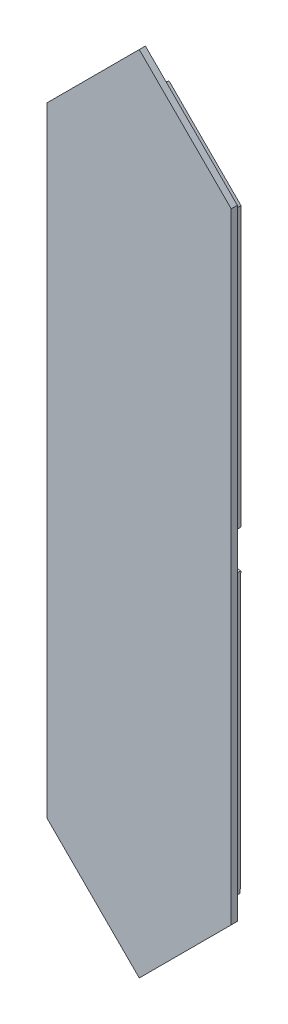
ISO-10303-21;
HEADER;
FILE_DESCRIPTION(('STEP AP214'),'2;1');
FILE_NAME('part.step','',(''),(''),'','','');
FILE_SCHEMA(('AUTOMOTIVE_DESIGN { 1 0 10303 214 1 1 1 1 }'));
ENDSEC;
DATA;
#1=APPLICATION_CONTEXT('core data for automotive mechanical design processes');
#2=APPLICATION_PROTOCOL_DEFINITION('international standard','automotive_design',2000,#1);
#3=PRODUCT_CONTEXT('',#1,'mechanical');
#4=PRODUCT('Part','Part','',(#3));
#5=PRODUCT_RELATED_PRODUCT_CATEGORY('part','',(#4));
#6=PRODUCT_DEFINITION_FORMATION('','',#4);
#7=PRODUCT_DEFINITION_CONTEXT('part definition',#1,'design');
#8=PRODUCT_DEFINITION('design','',#6,#7);
#9=PRODUCT_DEFINITION_SHAPE('','',#8);
#10=(LENGTH_UNIT() NAMED_UNIT(*) SI_UNIT(.MILLI.,.METRE.));
#11=(NAMED_UNIT(*) PLANE_ANGLE_UNIT() SI_UNIT($,.RADIAN.));
#12=(NAMED_UNIT(*) SI_UNIT($,.STERADIAN.) SOLID_ANGLE_UNIT());
#13=UNCERTAINTY_MEASURE_WITH_UNIT(LENGTH_MEASURE(1.E-05),#10,'distance_accuracy_value','');
#14=(GEOMETRIC_REPRESENTATION_CONTEXT(3) GLOBAL_UNCERTAINTY_ASSIGNED_CONTEXT((#13)) GLOBAL_UNIT_ASSIGNED_CONTEXT((#10,
#11,#12)) REPRESENTATION_CONTEXT('',''));
#15=CARTESIAN_POINT('',(0.,0.,0.));
#16=DIRECTION('',(0.,0.,1.));
#17=DIRECTION('',(1.,0.,0.));
#18=AXIS2_PLACEMENT_3D('',#15,#16,#17);
#19=CARTESIAN_POINT('',(0.,62.,2.));
#20=DIRECTION('',(0.,0.,-1.));
#21=DIRECTION('',(-1.,0.,0.));
#22=AXIS2_PLACEMENT_3D('',#19,#20,#21);
#23=CYLINDRICAL_SURFACE('',#22,2.6);
#24=CARTESIAN_POINT('',(0.,62.,0.));
#25=DIRECTION('',(0.,0.,-1.));
#26=DIRECTION('',(1.,0.,0.));
#27=AXIS2_PLACEMENT_3D('',#24,#25,#26);
#28=CIRCLE('',#27,2.6);
#29=CARTESIAN_POINT('',(1.83847763108502,60.161522368915,0.));
#30=VERTEX_POINT('',#29);
#31=CARTESIAN_POINT('',(-1.83847763108503,60.161522368915,0.));
#32=VERTEX_POINT('',#31);
#33=EDGE_CURVE('E167',#30,#32,#28,.T.);
#34=ORIENTED_EDGE('',*,*,#33,.T.);
#35=DIRECTION('',(0.,0.,-1.));
#36=VECTOR('',#35,1.);
#37=CARTESIAN_POINT('',(-1.83847763108503,60.161522368915,2.));
#38=LINE('',#37,#36);
#39=CARTESIAN_POINT('',(-1.83847763108503,60.161522368915,2.));
#40=VERTEX_POINT('',#39);
#41=EDGE_CURVE('E11',#40,#32,#38,.T.);
#42=ORIENTED_EDGE('',*,*,#41,.F.);
#43=CARTESIAN_POINT('',(0.,62.,2.));
#44=DIRECTION('',(0.,0.,-1.));
#45=DIRECTION('',(1.,0.,0.));
#46=AXIS2_PLACEMENT_3D('',#43,#44,#45);
#47=CIRCLE('',#46,2.6);
#48=CARTESIAN_POINT('',(1.83847763108502,60.161522368915,2.));
#49=VERTEX_POINT('',#48);
#50=EDGE_CURVE('E190',#49,#40,#47,.T.);
#51=ORIENTED_EDGE('',*,*,#50,.F.);
#52=DIRECTION('',(0.,0.,-1.));
#53=VECTOR('',#52,1.);
#54=CARTESIAN_POINT('',(1.83847763108502,60.161522368915,2.));
#55=LINE('',#54,#53);
#56=EDGE_CURVE('E166',#49,#30,#55,.T.);
#57=ORIENTED_EDGE('',*,*,#56,.T.);
#58=EDGE_LOOP('',(#34,#42,#51,#57));
#59=FACE_BOUND('',#58,.T.);
#60=ADVANCED_FACE('F34',(#59),#23,.F.);
#61=CARTESIAN_POINT('',(-1.83847763108503,60.161522368915,2.));
#62=DIRECTION('',(0.704379980368026,-0.709823107018036,0.));
#63=DIRECTION('',(0.709823107018037,0.704379980368026,0.));
#64=AXIS2_PLACEMENT_3D('',#61,#62,#63);
#65=PLANE('',#64);
#66=DIRECTION('',(-0.709823107018037,-0.704379980368026,0.));
#67=VECTOR('',#66,1.);
#68=CARTESIAN_POINT('',(-1.83847763108503,60.161522368915,0.));
#69=LINE('',#68,#67);
#70=CARTESIAN_POINT('',(-13.1033285786008,48.9830535211007,0.));
#71=VERTEX_POINT('',#70);
#72=EDGE_CURVE('E170',#32,#71,#69,.T.);
#73=ORIENTED_EDGE('',*,*,#72,.T.);
#74=DIRECTION('',(0.,0.,-1.));
#75=VECTOR('',#74,1.);
#76=CARTESIAN_POINT('',(-13.1033285786008,48.9830535211007,2.));
#77=LINE('',#76,#75);
#78=CARTESIAN_POINT('',(-13.1033285786008,48.9830535211007,2.));
#79=VERTEX_POINT('',#78);
#80=EDGE_CURVE('E42',#79,#71,#77,.T.);
#81=ORIENTED_EDGE('',*,*,#80,.F.);
#82=DIRECTION('',(-0.709823107018037,-0.704379980368026,0.));
#83=VECTOR('',#82,1.);
#84=CARTESIAN_POINT('',(-1.83847763108503,60.161522368915,2.));
#85=LINE('',#84,#83);
#86=EDGE_CURVE('E104',#40,#79,#85,.T.);
#87=ORIENTED_EDGE('',*,*,#86,.F.);
#88=ORIENTED_EDGE('',*,*,#41,.T.);
#89=EDGE_LOOP('',(#73,#81,#87,#88));
#90=FACE_BOUND('',#89,.T.);
#91=ADVANCED_FACE('F354',(#90),#65,.F.);
#92=CARTESIAN_POINT('',(-13.1033285786008,48.9830535211007,2.));
#93=DIRECTION('',(1.,0.,0.));
#94=DIRECTION('',(0.,0.,-1.));
#95=AXIS2_PLACEMENT_3D('',#92,#93,#94);
#96=PLANE('',#95);
#97=DIRECTION('',(0.,-1.,0.));
#98=VECTOR('',#97,1.);
#99=CARTESIAN_POINT('',(-13.1033285786008,48.9830535211007,0.));
#100=LINE('',#99,#98);
#101=CARTESIAN_POINT('',(-13.1033285786008,3.07451651214383,0.));
#102=VERTEX_POINT('',#101);
#103=EDGE_CURVE('E173',#71,#102,#100,.T.);
#104=ORIENTED_EDGE('',*,*,#103,.T.);
#105=DIRECTION('',(0.,0.,-1.));
#106=VECTOR('',#105,1.);
#107=CARTESIAN_POINT('',(-13.1033285786008,3.07451651214383,2.));
#108=LINE('',#107,#106);
#109=CARTESIAN_POINT('',(-13.1033285786008,3.07451651214383,2.));
#110=VERTEX_POINT('',#109);
#111=EDGE_CURVE('E207',#110,#102,#108,.T.);
#112=ORIENTED_EDGE('',*,*,#111,.F.);
#113=DIRECTION('',(0.,-1.,0.));
#114=VECTOR('',#113,1.);
#115=CARTESIAN_POINT('',(-13.1033285786008,48.9830535211007,2.));
#116=LINE('',#115,#114);
#117=EDGE_CURVE('E215',#79,#110,#116,.T.);
#118=ORIENTED_EDGE('',*,*,#117,.F.);
#119=ORIENTED_EDGE('',*,*,#80,.T.);
#120=EDGE_LOOP('',(#104,#112,#118,#119));
#121=FACE_BOUND('',#120,.T.);
#122=ADVANCED_FACE('F213',(#121),#96,.F.);
#123=CARTESIAN_POINT('',(-13.5000000000001,0.,2.));
#124=DIRECTION('',(0.,0.,-1.));
#125=DIRECTION('',(-1.,0.,0.));
#126=AXIS2_PLACEMENT_3D('',#123,#124,#125);
#127=CYLINDRICAL_SURFACE('',#126,3.1);
#128=CARTESIAN_POINT('',(-13.5000000000001,0.,0.));
#129=DIRECTION('',(0.,0.,-1.));
#130=DIRECTION('',(1.,0.,0.));
#131=AXIS2_PLACEMENT_3D('',#128,#129,#130);
#132=CIRCLE('',#131,3.1);
#133=CARTESIAN_POINT('',(-13.1033285786008,-3.07451651214383,0.));
#134=VERTEX_POINT('',#133);
#135=EDGE_CURVE('E175',#102,#134,#132,.T.);
#136=ORIENTED_EDGE('',*,*,#135,.T.);
#137=DIRECTION('',(0.,0.,-1.));
#138=VECTOR('',#137,1.);
#139=CARTESIAN_POINT('',(-13.1033285786008,-3.07451651214383,2.));
#140=LINE('',#139,#138);
#141=CARTESIAN_POINT('',(-13.1033285786008,-3.07451651214383,2.));
#142=VERTEX_POINT('',#141);
#143=EDGE_CURVE('E204',#142,#134,#140,.T.);
#144=ORIENTED_EDGE('',*,*,#143,.F.);
#145=CARTESIAN_POINT('',(-13.5000000000001,0.,2.));
#146=DIRECTION('',(0.,0.,-1.));
#147=DIRECTION('',(1.,0.,0.));
#148=AXIS2_PLACEMENT_3D('',#145,#146,#147);
#149=CIRCLE('',#148,3.1);
#150=EDGE_CURVE('E234',#110,#142,#149,.T.);
#151=ORIENTED_EDGE('',*,*,#150,.F.);
#152=ORIENTED_EDGE('',*,*,#111,.T.);
#153=EDGE_LOOP('',(#136,#144,#151,#152));
#154=FACE_BOUND('',#153,.T.);
#155=ADVANCED_FACE('F223',(#154),#127,.F.);
#156=CARTESIAN_POINT('',(-13.1033285786008,-3.07451651214383,2.));
#157=DIRECTION('',(0.999998333354842,-0.00182572931658265,0.));
#158=DIRECTION('',(0.00182572931658265,0.999998333354842,0.));
#159=AXIS2_PLACEMENT_3D('',#156,#157,#158);
#160=PLANE('',#159);
#161=DIRECTION('',(-0.00182572931658265,-0.999998333354842,0.));
#162=VECTOR('',#161,1.);
#163=CARTESIAN_POINT('',(-13.1033285786008,-3.07451651214383,0.));
#164=LINE('',#163,#162);
#165=CARTESIAN_POINT('',(-13.1868351090227,-48.8131648909774,0.));
#166=VERTEX_POINT('',#165);
#167=EDGE_CURVE('E177',#134,#166,#164,.T.);
#168=ORIENTED_EDGE('',*,*,#167,.T.);
#169=DIRECTION('',(0.,0.,-1.));
#170=VECTOR('',#169,1.);
#171=CARTESIAN_POINT('',(-13.1868351090227,-48.8131648909774,2.));
#172=LINE('',#171,#170);
#173=CARTESIAN_POINT('',(-13.1868351090227,-48.8131648909774,2.));
#174=VERTEX_POINT('',#173);
#175=EDGE_CURVE('E201',#174,#166,#172,.T.);
#176=ORIENTED_EDGE('',*,*,#175,.F.);
#177=DIRECTION('',(-0.00182572931658265,-0.999998333354842,0.));
#178=VECTOR('',#177,1.);
#179=CARTESIAN_POINT('',(-13.1033285786008,-3.07451651214383,2.));
#180=LINE('',#179,#178);
#181=EDGE_CURVE('E229',#142,#174,#180,.T.);
#182=ORIENTED_EDGE('',*,*,#181,.F.);
#183=ORIENTED_EDGE('',*,*,#143,.T.);
#184=EDGE_LOOP('',(#168,#176,#182,#183));
#185=FACE_BOUND('',#184,.T.);
#186=ADVANCED_FACE('F227',(#185),#160,.F.);
#187=CARTESIAN_POINT('',(-13.1868351090227,-48.8131648909774,2.));
#188=DIRECTION('',(0.707106781186547,0.707106781186547,0.));
#189=DIRECTION('',(-0.707106781186548,0.707106781186548,0.));
#190=AXIS2_PLACEMENT_3D('',#187,#188,#189);
#191=PLANE('',#190);
#192=DIRECTION('',(0.707106781186547,-0.707106781186547,0.));
#193=VECTOR('',#192,1.);
#194=CARTESIAN_POINT('',(-13.1868351090227,-48.8131648909774,0.));
#195=LINE('',#194,#193);
#196=CARTESIAN_POINT('',(-1.83847763108514,-60.161522368915,0.));
#197=VERTEX_POINT('',#196);
#198=EDGE_CURVE('E179',#166,#197,#195,.T.);
#199=ORIENTED_EDGE('',*,*,#198,.T.);
#200=DIRECTION('',(0.,0.,-1.));
#201=VECTOR('',#200,1.);
#202=CARTESIAN_POINT('',(-1.83847763108514,-60.161522368915,2.));
#203=LINE('',#202,#201);
#204=CARTESIAN_POINT('',(-1.83847763108514,-60.161522368915,2.));
#205=VERTEX_POINT('',#204);
#206=EDGE_CURVE('E198',#205,#197,#203,.T.);
#207=ORIENTED_EDGE('',*,*,#206,.F.);
#208=DIRECTION('',(0.707106781186547,-0.707106781186547,0.));
#209=VECTOR('',#208,1.);
#210=CARTESIAN_POINT('',(-13.1868351090227,-48.8131648909774,2.));
#211=LINE('',#210,#209);
#212=EDGE_CURVE('E233',#174,#205,#211,.T.);
#213=ORIENTED_EDGE('',*,*,#212,.F.);
#214=ORIENTED_EDGE('',*,*,#175,.T.);
#215=EDGE_LOOP('',(#199,#207,#213,#214));
#216=FACE_BOUND('',#215,.T.);
#217=ADVANCED_FACE('F367',(#216),#191,.F.);
#218=CARTESIAN_POINT('',(-1.32427131676642E-13,-62.,2.));
#219=DIRECTION('',(0.,0.,-1.));
#220=DIRECTION('',(-1.,0.,0.));
#221=AXIS2_PLACEMENT_3D('',#218,#219,#220);
#222=CYLINDRICAL_SURFACE('',#221,2.6);
#223=CARTESIAN_POINT('',(-1.32427131676642E-13,-62.,0.));
#224=DIRECTION('',(0.,0.,-1.));
#225=DIRECTION('',(1.,0.,0.));
#226=AXIS2_PLACEMENT_3D('',#223,#224,#225);
#227=CIRCLE('',#226,2.6);
#228=CARTESIAN_POINT('',(1.83847763108488,-60.161522368915,0.));
#229=VERTEX_POINT('',#228);
#230=EDGE_CURVE('E181',#197,#229,#227,.T.);
#231=ORIENTED_EDGE('',*,*,#230,.T.);
#232=DIRECTION('',(0.,0.,-1.));
#233=VECTOR('',#232,1.);
#234=CARTESIAN_POINT('',(1.83847763108488,-60.161522368915,2.));
#235=LINE('',#234,#233);
#236=CARTESIAN_POINT('',(1.83847763108488,-60.161522368915,2.));
#237=VERTEX_POINT('',#236);
#238=EDGE_CURVE('E195',#237,#229,#235,.T.);
#239=ORIENTED_EDGE('',*,*,#238,.F.);
#240=CARTESIAN_POINT('',(-1.32427131676642E-13,-62.,2.));
#241=DIRECTION('',(0.,0.,-1.));
#242=DIRECTION('',(1.,0.,0.));
#243=AXIS2_PLACEMENT_3D('',#240,#241,#242);
#244=CIRCLE('',#243,2.6);
#245=EDGE_CURVE('E158',#205,#237,#244,.T.);
#246=ORIENTED_EDGE('',*,*,#245,.F.);
#247=ORIENTED_EDGE('',*,*,#206,.T.);
#248=EDGE_LOOP('',(#231,#239,#246,#247));
#249=FACE_BOUND('',#248,.T.);
#250=ADVANCED_FACE('F242',(#249),#222,.F.);
#251=CARTESIAN_POINT('',(1.83847763108488,-60.161522368915,2.));
#252=DIRECTION('',(-0.705787571806319,0.708423533970844,0.));
#253=DIRECTION('',(-0.708423533970844,-0.705787571806319,0.));
#254=AXIS2_PLACEMENT_3D('',#251,#252,#253);
#255=PLANE('',#254);
#256=DIRECTION('',(0.708423533970844,0.705787571806319,0.));
#257=VECTOR('',#256,1.);
#258=CARTESIAN_POINT('',(1.83847763108488,-60.161522368915,0.));
#259=LINE('',#258,#257);
#260=CARTESIAN_POINT('',(13.4432523333034,-48.5999276932992,0.));
#261=VERTEX_POINT('',#260);
#262=EDGE_CURVE('E183',#229,#261,#259,.T.);
#263=ORIENTED_EDGE('',*,*,#262,.T.);
#264=DIRECTION('',(0.,0.,-1.));
#265=VECTOR('',#264,1.);
#266=CARTESIAN_POINT('',(13.4432523333034,-48.5999276932992,2.));
#267=LINE('',#266,#265);
#268=CARTESIAN_POINT('',(13.4432523333034,-48.5999276932992,2.));
#269=VERTEX_POINT('',#268);
#270=EDGE_CURVE('E142',#269,#261,#267,.T.);
#271=ORIENTED_EDGE('',*,*,#270,.F.);
#272=DIRECTION('',(0.708423533970844,0.705787571806319,0.));
#273=VECTOR('',#272,1.);
#274=CARTESIAN_POINT('',(1.83847763108488,-60.161522368915,2.));
#275=LINE('',#274,#273);
#276=EDGE_CURVE('E156',#237,#269,#275,.T.);
#277=ORIENTED_EDGE('',*,*,#276,.F.);
#278=ORIENTED_EDGE('',*,*,#238,.T.);
#279=EDGE_LOOP('',(#263,#271,#277,#278));
#280=FACE_BOUND('',#279,.T.);
#281=ADVANCED_FACE('F246',(#280),#255,.F.);
#282=CARTESIAN_POINT('',(13.4432523333034,-48.5999276932992,2.));
#283=DIRECTION('',(-0.999998333354842,0.0018257293165825,0.));
#284=DIRECTION('',(-0.0018257293165825,-0.999998333354842,0.));
#285=AXIS2_PLACEMENT_3D('',#282,#283,#284);
#286=PLANE('',#285);
#287=DIRECTION('',(0.0018257293165825,0.999998333354842,0.));
#288=VECTOR('',#287,1.);
#289=CARTESIAN_POINT('',(13.4432523333034,-48.5999276932992,0.));
#290=LINE('',#289,#288);
#291=CARTESIAN_POINT('',(13.5263232276925,-3.09988823793437,0.));
#292=VERTEX_POINT('',#291);
#293=EDGE_CURVE('E139',#261,#292,#290,.T.);
#294=ORIENTED_EDGE('',*,*,#293,.T.);
#295=DIRECTION('',(0.,0.,-1.));
#296=VECTOR('',#295,1.);
#297=CARTESIAN_POINT('',(13.5263232276925,-3.09988823793437,2.));
#298=LINE('',#297,#296);
#299=CARTESIAN_POINT('',(13.5263232276925,-3.09988823793437,2.));
#300=VERTEX_POINT('',#299);
#301=EDGE_CURVE('E131',#300,#292,#298,.T.);
#302=ORIENTED_EDGE('',*,*,#301,.F.);
#303=DIRECTION('',(0.0018257293165825,0.999998333354842,0.));
#304=VECTOR('',#303,1.);
#305=CARTESIAN_POINT('',(13.4432523333034,-48.5999276932992,2.));
#306=LINE('',#305,#304);
#307=EDGE_CURVE('E136',#269,#300,#306,.T.);
#308=ORIENTED_EDGE('',*,*,#307,.F.);
#309=ORIENTED_EDGE('',*,*,#270,.T.);
#310=EDGE_LOOP('',(#294,#302,#308,#309));
#311=FACE_BOUND('',#310,.T.);
#312=ADVANCED_FACE('F133',(#311),#286,.F.);
#313=CARTESIAN_POINT('',(13.5,0.,2.));
#314=DIRECTION('',(0.,0.,-1.));
#315=DIRECTION('',(-1.,0.,0.));
#316=AXIS2_PLACEMENT_3D('',#313,#314,#315);
#317=CYLINDRICAL_SURFACE('',#316,3.1);
#318=CARTESIAN_POINT('',(13.5,0.,0.));
#319=DIRECTION('',(0.,0.,-1.));
#320=DIRECTION('',(1.,0.,0.));
#321=AXIS2_PLACEMENT_3D('',#318,#319,#320);
#322=CIRCLE('',#321,3.1);
#323=CARTESIAN_POINT('',(13.5707106781187,3.09919344346235,0.));
#324=VERTEX_POINT('',#323);
#325=EDGE_CURVE('E186',#292,#324,#322,.T.);
#326=ORIENTED_EDGE('',*,*,#325,.T.);
#327=DIRECTION('',(0.,0.,-1.));
#328=VECTOR('',#327,1.);
#329=CARTESIAN_POINT('',(13.5707106781187,3.09919344346235,2.));
#330=LINE('',#329,#328);
#331=CARTESIAN_POINT('',(13.5707106781187,3.09919344346235,2.));
#332=VERTEX_POINT('',#331);
#333=EDGE_CURVE('E143',#332,#324,#330,.T.);
#334=ORIENTED_EDGE('',*,*,#333,.F.);
#335=CARTESIAN_POINT('',(13.5,0.,2.));
#336=DIRECTION('',(0.,0.,-1.));
#337=DIRECTION('',(1.,0.,0.));
#338=AXIS2_PLACEMENT_3D('',#335,#336,#337);
#339=CIRCLE('',#338,3.1);
#340=EDGE_CURVE('E146',#300,#332,#339,.T.);
#341=ORIENTED_EDGE('',*,*,#340,.F.);
#342=ORIENTED_EDGE('',*,*,#301,.T.);
#343=EDGE_LOOP('',(#326,#334,#341,#342));
#344=FACE_BOUND('',#343,.T.);
#345=ADVANCED_FACE('F147',(#344),#317,.F.);
#346=CARTESIAN_POINT('',(13.5707106781187,3.09919344346235,2.));
#347=DIRECTION('',(-1.,0.,0.));
#348=DIRECTION('',(0.,-1.,0.));
#349=AXIS2_PLACEMENT_3D('',#346,#347,#348);
#350=PLANE('',#349);
#351=DIRECTION('',(0.,1.,0.));
#352=VECTOR('',#351,1.);
#353=CARTESIAN_POINT('',(13.5707106781187,3.09919344346235,0.));
#354=LINE('',#353,#352);
#355=CARTESIAN_POINT('',(13.5707106781187,48.4292893218813,0.));
#356=VERTEX_POINT('',#355);
#357=EDGE_CURVE('E90',#324,#356,#354,.T.);
#358=ORIENTED_EDGE('',*,*,#357,.T.);
#359=DIRECTION('',(0.,0.,-1.));
#360=VECTOR('',#359,1.);
#361=CARTESIAN_POINT('',(13.5707106781187,48.4292893218813,2.));
#362=LINE('',#361,#360);
#363=CARTESIAN_POINT('',(13.5707106781187,48.4292893218813,2.));
#364=VERTEX_POINT('',#363);
#365=EDGE_CURVE('E50',#364,#356,#362,.T.);
#366=ORIENTED_EDGE('',*,*,#365,.F.);
#367=DIRECTION('',(0.,1.,0.));
#368=VECTOR('',#367,1.);
#369=CARTESIAN_POINT('',(13.5707106781187,3.09919344346235,2.));
#370=LINE('',#369,#368);
#371=EDGE_CURVE('E150',#332,#364,#370,.T.);
#372=ORIENTED_EDGE('',*,*,#371,.F.);
#373=ORIENTED_EDGE('',*,*,#333,.T.);
#374=EDGE_LOOP('',(#358,#366,#372,#373));
#375=FACE_BOUND('',#374,.T.);
#376=ADVANCED_FACE('F247',(#375),#350,.F.);
#377=CARTESIAN_POINT('',(13.5707106781187,48.4292893218813,2.));
#378=DIRECTION('',(-0.707106781186547,-0.707106781186547,0.));
#379=DIRECTION('',(0.707106781186548,-0.707106781186548,0.));
#380=AXIS2_PLACEMENT_3D('',#377,#378,#379);
#381=PLANE('',#380);
#382=DIRECTION('',(-0.707106781186548,0.707106781186548,0.));
#383=VECTOR('',#382,1.);
#384=CARTESIAN_POINT('',(13.5707106781187,48.4292893218813,0.));
#385=LINE('',#384,#383);
#386=EDGE_CURVE('E96',#356,#30,#385,.T.);
#387=ORIENTED_EDGE('',*,*,#386,.T.);
#388=ORIENTED_EDGE('',*,*,#56,.F.);
#389=DIRECTION('',(-0.707106781186548,0.707106781186548,0.));
#390=VECTOR('',#389,1.);
#391=CARTESIAN_POINT('',(13.5707106781187,48.4292893218813,2.));
#392=LINE('',#391,#390);
#393=EDGE_CURVE('E163',#364,#49,#392,.T.);
#394=ORIENTED_EDGE('',*,*,#393,.F.);
#395=ORIENTED_EDGE('',*,*,#365,.T.);
#396=EDGE_LOOP('',(#387,#388,#394,#395));
#397=FACE_BOUND('',#396,.T.);
#398=ADVANCED_FACE('F250',(#397),#381,.F.);
#399=CARTESIAN_POINT('',(0.,62.,0.));
#400=DIRECTION('',(0.,0.,1.));
#401=DIRECTION('',(1.,0.,0.));
#402=AXIS2_PLACEMENT_3D('',#399,#400,#401);
#403=PLANE('',#402);
#404=ORIENTED_EDGE('',*,*,#33,.F.);
#405=ORIENTED_EDGE('',*,*,#386,.F.);
#406=ORIENTED_EDGE('',*,*,#357,.F.);
#407=ORIENTED_EDGE('',*,*,#325,.F.);
#408=ORIENTED_EDGE('',*,*,#293,.F.);
#409=ORIENTED_EDGE('',*,*,#262,.F.);
#410=ORIENTED_EDGE('',*,*,#230,.F.);
#411=ORIENTED_EDGE('',*,*,#198,.F.);
#412=ORIENTED_EDGE('',*,*,#167,.F.);
#413=ORIENTED_EDGE('',*,*,#135,.F.);
#414=ORIENTED_EDGE('',*,*,#103,.F.);
#415=ORIENTED_EDGE('',*,*,#72,.F.);
#416=EDGE_LOOP('',(#404,#405,#406,#407,#408,#409,#410,#411,#412,#413,#414,#415));
#417=FACE_BOUND('',#416,.T.);
#418=ADVANCED_FACE('F219',(#417),#403,.F.);
#419=CARTESIAN_POINT('',(0.,0.,2.));
#420=DIRECTION('',(0.,0.,-1.));
#421=DIRECTION('',(-1.,0.,0.));
#422=AXIS2_PLACEMENT_3D('',#419,#420,#421);
#423=PLANE('',#422);
#424=DIRECTION('',(-0.707106781186548,0.707106781186547,0.));
#425=VECTOR('',#424,1.);
#426=CARTESIAN_POINT('',(0.,65.1512808209396,2.));
#427=LINE('',#426,#425);
#428=CARTESIAN_POINT('',(14.9718446146518,50.1794362062877,2.));
#429=VERTEX_POINT('',#428);
#430=CARTESIAN_POINT('',(0.,65.1512808209396,2.));
#431=VERTEX_POINT('',#430);
#432=EDGE_CURVE('E288',#429,#431,#427,.T.);
#433=ORIENTED_EDGE('',*,*,#432,.F.);
#434=DIRECTION('',(0.,1.,0.));
#435=VECTOR('',#434,1.);
#436=CARTESIAN_POINT('',(14.9718446146518,50.1794362062877,2.));
#437=LINE('',#436,#435);
#438=CARTESIAN_POINT('',(14.9718446146519,-50.8089171804031,2.));
#439=VERTEX_POINT('',#438);
#440=EDGE_CURVE('E272',#439,#429,#437,.T.);
#441=ORIENTED_EDGE('',*,*,#440,.F.);
#442=DIRECTION('',(0.707106781186548,0.707106781186547,0.));
#443=VECTOR('',#442,1.);
#444=CARTESIAN_POINT('',(14.9718446146519,-50.8089171804031,2.));
#445=LINE('',#444,#443);
#446=CARTESIAN_POINT('',(0.,-65.7807617950549,2.));
#447=VERTEX_POINT('',#446);
#448=EDGE_CURVE('E276',#447,#439,#445,.T.);
#449=ORIENTED_EDGE('',*,*,#448,.F.);
#450=DIRECTION('',(0.707106781186547,-0.707106781186548,0.));
#451=VECTOR('',#450,1.);
#452=CARTESIAN_POINT('',(-15.0281553853481,-50.7526064097068,2.));
#453=LINE('',#452,#451);
#454=CARTESIAN_POINT('',(-15.0281553853481,-50.7526064097068,2.));
#455=VERTEX_POINT('',#454);
#456=EDGE_CURVE('E279',#455,#447,#453,.T.);
#457=ORIENTED_EDGE('',*,*,#456,.F.);
#458=DIRECTION('',(0.,-1.,0.));
#459=VECTOR('',#458,1.);
#460=CARTESIAN_POINT('',(-15.0281553853481,50.1231254355914,2.));
#461=LINE('',#460,#459);
#462=CARTESIAN_POINT('',(-15.0281553853481,50.1231254355914,2.));
#463=VERTEX_POINT('',#462);
#464=EDGE_CURVE('E282',#463,#455,#461,.T.);
#465=ORIENTED_EDGE('',*,*,#464,.F.);
#466=DIRECTION('',(-0.707106781186547,-0.707106781186548,0.));
#467=VECTOR('',#466,1.);
#468=CARTESIAN_POINT('',(0.,65.1512808209396,2.));
#469=LINE('',#468,#467);
#470=EDGE_CURVE('E285',#431,#463,#469,.T.);
#471=ORIENTED_EDGE('',*,*,#470,.F.);
#472=EDGE_LOOP('',(#433,#441,#449,#457,#465,#471));
#473=FACE_BOUND('',#472,.T.);
#474=ORIENTED_EDGE('',*,*,#50,.T.);
#475=ORIENTED_EDGE('',*,*,#86,.T.);
#476=ORIENTED_EDGE('',*,*,#117,.T.);
#477=ORIENTED_EDGE('',*,*,#150,.T.);
#478=ORIENTED_EDGE('',*,*,#181,.T.);
#479=ORIENTED_EDGE('',*,*,#212,.T.);
#480=ORIENTED_EDGE('',*,*,#245,.T.);
#481=ORIENTED_EDGE('',*,*,#276,.T.);
#482=ORIENTED_EDGE('',*,*,#307,.T.);
#483=ORIENTED_EDGE('',*,*,#340,.T.);
#484=ORIENTED_EDGE('',*,*,#371,.T.);
#485=ORIENTED_EDGE('',*,*,#393,.T.);
#486=EDGE_LOOP('',(#474,#475,#476,#477,#478,#479,#480,#481,#482,#483,#484,#485));
#487=FACE_BOUND('',#486,.T.);
#488=ADVANCED_FACE('F153',(#473,#487),#423,.T.);
#489=CARTESIAN_POINT('',(0.,65.1512808209396,3.));
#490=DIRECTION('',(-0.707106781186547,-0.707106781186548,0.));
#491=DIRECTION('',(0.707106781186548,-0.707106781186547,0.));
#492=AXIS2_PLACEMENT_3D('',#489,#490,#491);
#493=PLANE('',#492);
#494=ORIENTED_EDGE('',*,*,#432,.T.);
#495=DIRECTION('',(0.,0.,-1.));
#496=VECTOR('',#495,1.);
#497=CARTESIAN_POINT('',(0.,65.1512808209396,3.));
#498=LINE('',#497,#496);
#499=CARTESIAN_POINT('',(0.,65.1512808209396,3.));
#500=VERTEX_POINT('',#499);
#501=EDGE_CURVE('E171',#500,#431,#498,.T.);
#502=ORIENTED_EDGE('',*,*,#501,.F.);
#503=DIRECTION('',(-0.707106781186548,0.707106781186547,0.));
#504=VECTOR('',#503,1.);
#505=CARTESIAN_POINT('',(0.,65.1512808209396,3.));
#506=LINE('',#505,#504);
#507=CARTESIAN_POINT('',(14.9718446146518,50.1794362062877,3.));
#508=VERTEX_POINT('',#507);
#509=EDGE_CURVE('E275',#508,#500,#506,.T.);
#510=ORIENTED_EDGE('',*,*,#509,.F.);
#511=DIRECTION('',(0.,0.,-1.));
#512=VECTOR('',#511,1.);
#513=CARTESIAN_POINT('',(14.9718446146518,50.1794362062877,3.));
#514=LINE('',#513,#512);
#515=EDGE_CURVE('E268',#508,#429,#514,.T.);
#516=ORIENTED_EDGE('',*,*,#515,.T.);
#517=EDGE_LOOP('',(#494,#502,#510,#516));
#518=FACE_BOUND('',#517,.T.);
#519=ADVANCED_FACE('F319',(#518),#493,.F.);
#520=CARTESIAN_POINT('',(0.,65.1512808209396,3.));
#521=DIRECTION('',(0.707106781186548,-0.707106781186547,0.));
#522=DIRECTION('',(0.707106781186547,0.707106781186548,0.));
#523=AXIS2_PLACEMENT_3D('',#520,#521,#522);
#524=PLANE('',#523);
#525=ORIENTED_EDGE('',*,*,#470,.T.);
#526=DIRECTION('',(0.,0.,-1.));
#527=VECTOR('',#526,1.);
#528=CARTESIAN_POINT('',(-15.0281553853481,50.1231254355914,3.));
#529=LINE('',#528,#527);
#530=CARTESIAN_POINT('',(-15.0281553853481,50.1231254355914,3.));
#531=VERTEX_POINT('',#530);
#532=EDGE_CURVE('E256',#531,#463,#529,.T.);
#533=ORIENTED_EDGE('',*,*,#532,.F.);
#534=DIRECTION('',(-0.707106781186547,-0.707106781186548,0.));
#535=VECTOR('',#534,1.);
#536=CARTESIAN_POINT('',(0.,65.1512808209396,3.));
#537=LINE('',#536,#535);
#538=EDGE_CURVE('E302',#500,#531,#537,.T.);
#539=ORIENTED_EDGE('',*,*,#538,.F.);
#540=ORIENTED_EDGE('',*,*,#501,.T.);
#541=EDGE_LOOP('',(#525,#533,#539,#540));
#542=FACE_BOUND('',#541,.T.);
#543=ADVANCED_FACE('F323',(#542),#524,.F.);
#544=CARTESIAN_POINT('',(-15.0281553853481,50.1231254355914,3.));
#545=DIRECTION('',(1.,0.,0.));
#546=DIRECTION('',(0.,0.,-1.));
#547=AXIS2_PLACEMENT_3D('',#544,#545,#546);
#548=PLANE('',#547);
#549=ORIENTED_EDGE('',*,*,#464,.T.);
#550=DIRECTION('',(0.,0.,-1.));
#551=VECTOR('',#550,1.);
#552=CARTESIAN_POINT('',(-15.0281553853481,-50.7526064097068,3.));
#553=LINE('',#552,#551);
#554=CARTESIAN_POINT('',(-15.0281553853481,-50.7526064097068,3.));
#555=VERTEX_POINT('',#554);
#556=EDGE_CURVE('E259',#555,#455,#553,.T.);
#557=ORIENTED_EDGE('',*,*,#556,.F.);
#558=DIRECTION('',(0.,-1.,0.));
#559=VECTOR('',#558,1.);
#560=CARTESIAN_POINT('',(-15.0281553853481,50.1231254355914,3.));
#561=LINE('',#560,#559);
#562=EDGE_CURVE('E299',#531,#555,#561,.T.);
#563=ORIENTED_EDGE('',*,*,#562,.F.);
#564=ORIENTED_EDGE('',*,*,#532,.T.);
#565=EDGE_LOOP('',(#549,#557,#563,#564));
#566=FACE_BOUND('',#565,.T.);
#567=ADVANCED_FACE('F385',(#566),#548,.F.);
#568=CARTESIAN_POINT('',(-15.0281553853481,-50.7526064097068,3.));
#569=DIRECTION('',(0.707106781186548,0.707106781186547,0.));
#570=DIRECTION('',(-0.707106781186547,0.707106781186548,0.));
#571=AXIS2_PLACEMENT_3D('',#568,#569,#570);
#572=PLANE('',#571);
#573=ORIENTED_EDGE('',*,*,#456,.T.);
#574=DIRECTION('',(0.,0.,-1.));
#575=VECTOR('',#574,1.);
#576=CARTESIAN_POINT('',(0.,-65.7807617950549,3.));
#577=LINE('',#576,#575);
#578=CARTESIAN_POINT('',(0.,-65.7807617950549,3.));
#579=VERTEX_POINT('',#578);
#580=EDGE_CURVE('E262',#579,#447,#577,.T.);
#581=ORIENTED_EDGE('',*,*,#580,.F.);
#582=DIRECTION('',(0.707106781186547,-0.707106781186548,0.));
#583=VECTOR('',#582,1.);
#584=CARTESIAN_POINT('',(-15.0281553853481,-50.7526064097068,3.));
#585=LINE('',#584,#583);
#586=EDGE_CURVE('E296',#555,#579,#585,.T.);
#587=ORIENTED_EDGE('',*,*,#586,.F.);
#588=ORIENTED_EDGE('',*,*,#556,.T.);
#589=EDGE_LOOP('',(#573,#581,#587,#588));
#590=FACE_BOUND('',#589,.T.);
#591=ADVANCED_FACE('F388',(#590),#572,.F.);
#592=CARTESIAN_POINT('',(14.9718446146519,-50.8089171804031,3.));
#593=DIRECTION('',(-0.707106781186547,0.707106781186548,0.));
#594=DIRECTION('',(-0.707106781186548,-0.707106781186547,0.));
#595=AXIS2_PLACEMENT_3D('',#592,#593,#594);
#596=PLANE('',#595);
#597=ORIENTED_EDGE('',*,*,#448,.T.);
#598=DIRECTION('',(0.,0.,-1.));
#599=VECTOR('',#598,1.);
#600=CARTESIAN_POINT('',(14.9718446146519,-50.8089171804031,3.));
#601=LINE('',#600,#599);
#602=CARTESIAN_POINT('',(14.9718446146519,-50.8089171804031,3.));
#603=VERTEX_POINT('',#602);
#604=EDGE_CURVE('E265',#603,#439,#601,.T.);
#605=ORIENTED_EDGE('',*,*,#604,.F.);
#606=DIRECTION('',(0.707106781186548,0.707106781186547,0.));
#607=VECTOR('',#606,1.);
#608=CARTESIAN_POINT('',(14.9718446146519,-50.8089171804031,3.));
#609=LINE('',#608,#607);
#610=EDGE_CURVE('E293',#579,#603,#609,.T.);
#611=ORIENTED_EDGE('',*,*,#610,.F.);
#612=ORIENTED_EDGE('',*,*,#580,.T.);
#613=EDGE_LOOP('',(#597,#605,#611,#612));
#614=FACE_BOUND('',#613,.T.);
#615=ADVANCED_FACE('F392',(#614),#596,.F.);
#616=CARTESIAN_POINT('',(14.9718446146518,50.1794362062877,3.));
#617=DIRECTION('',(-1.,0.,0.));
#618=DIRECTION('',(0.,-1.,0.));
#619=AXIS2_PLACEMENT_3D('',#616,#617,#618);
#620=PLANE('',#619);
#621=ORIENTED_EDGE('',*,*,#440,.T.);
#622=ORIENTED_EDGE('',*,*,#515,.F.);
#623=DIRECTION('',(0.,1.,0.));
#624=VECTOR('',#623,1.);
#625=CARTESIAN_POINT('',(14.9718446146518,50.1794362062877,3.));
#626=LINE('',#625,#624);
#627=EDGE_CURVE('E271',#603,#508,#626,.T.);
#628=ORIENTED_EDGE('',*,*,#627,.F.);
#629=ORIENTED_EDGE('',*,*,#604,.T.);
#630=EDGE_LOOP('',(#621,#622,#628,#629));
#631=FACE_BOUND('',#630,.T.);
#632=ADVANCED_FACE('F340',(#631),#620,.F.);
#633=CARTESIAN_POINT('',(0.,0.,3.));
#634=DIRECTION('',(0.,0.,-1.));
#635=DIRECTION('',(-1.,0.,0.));
#636=AXIS2_PLACEMENT_3D('',#633,#634,#635);
#637=PLANE('',#636);
#638=ORIENTED_EDGE('',*,*,#509,.T.);
#639=ORIENTED_EDGE('',*,*,#538,.T.);
#640=ORIENTED_EDGE('',*,*,#562,.T.);
#641=ORIENTED_EDGE('',*,*,#586,.T.);
#642=ORIENTED_EDGE('',*,*,#610,.T.);
#643=ORIENTED_EDGE('',*,*,#627,.T.);
#644=EDGE_LOOP('',(#638,#639,#640,#641,#642,#643));
#645=FACE_BOUND('',#644,.T.);
#646=ADVANCED_FACE('F310',(#645),#637,.F.);
#647=CLOSED_SHELL('',(#60,#91,#122,#155,#186,#217,#250,#281,#312,#345,#376,#398,#418,#488,#519,
#543,#567,#591,#615,#632,#646));
#648=MANIFOLD_SOLID_BREP('B2',#647);
#649=ADVANCED_BREP_SHAPE_REPRESENTATION('',(#18,#648),#14);
#650=SHAPE_DEFINITION_REPRESENTATION(#9,#649);
ENDSEC;
END-ISO-10303-21;
